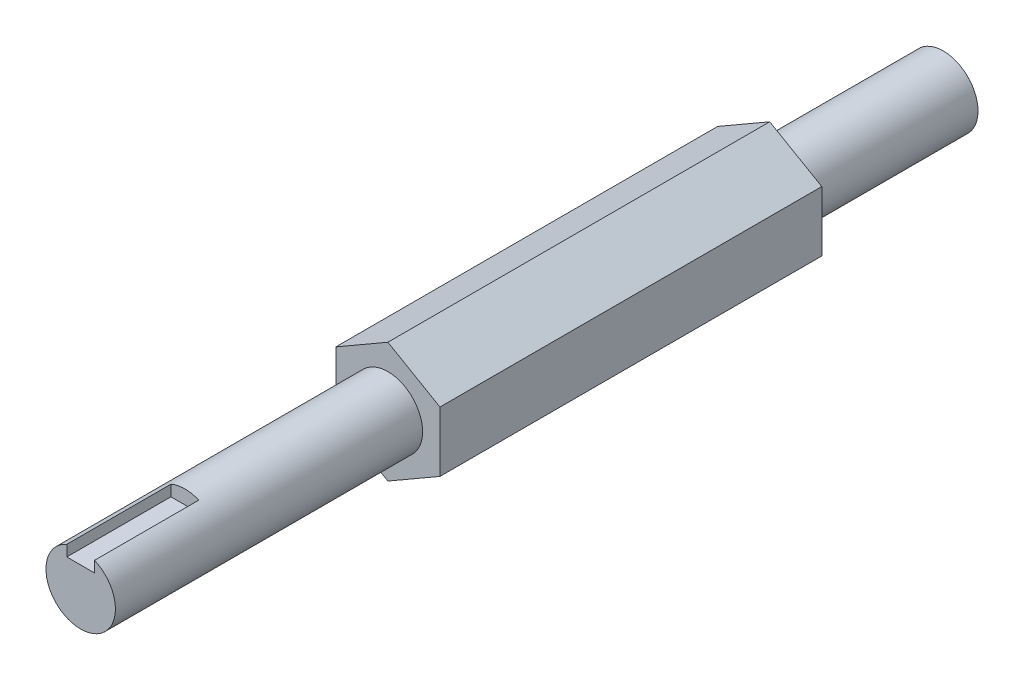
ISO-10303-21;
HEADER;
FILE_DESCRIPTION(('STEP AP214'),'2;1');
FILE_NAME('part.step','',(''),(''),'','','');
FILE_SCHEMA(('AUTOMOTIVE_DESIGN { 1 0 10303 214 1 1 1 1 }'));
ENDSEC;
DATA;
#1=APPLICATION_CONTEXT('core data for automotive mechanical design processes');
#2=APPLICATION_PROTOCOL_DEFINITION('international standard','automotive_design',2000,#1);
#3=PRODUCT_CONTEXT('',#1,'mechanical');
#4=PRODUCT('Part','Part','',(#3));
#5=PRODUCT_RELATED_PRODUCT_CATEGORY('part','',(#4));
#6=PRODUCT_DEFINITION_FORMATION('','',#4);
#7=PRODUCT_DEFINITION_CONTEXT('part definition',#1,'design');
#8=PRODUCT_DEFINITION('design','',#6,#7);
#9=PRODUCT_DEFINITION_SHAPE('','',#8);
#10=(LENGTH_UNIT() NAMED_UNIT(*) SI_UNIT(.MILLI.,.METRE.));
#11=(NAMED_UNIT(*) PLANE_ANGLE_UNIT() SI_UNIT($,.RADIAN.));
#12=(NAMED_UNIT(*) SI_UNIT($,.STERADIAN.) SOLID_ANGLE_UNIT());
#13=UNCERTAINTY_MEASURE_WITH_UNIT(LENGTH_MEASURE(1.E-05),#10,'distance_accuracy_value','');
#14=(GEOMETRIC_REPRESENTATION_CONTEXT(3) GLOBAL_UNCERTAINTY_ASSIGNED_CONTEXT((#13)) GLOBAL_UNIT_ASSIGNED_CONTEXT((#10,
#11,#12)) REPRESENTATION_CONTEXT('',''));
#15=CARTESIAN_POINT('',(0.,0.,0.));
#16=DIRECTION('',(0.,0.,1.));
#17=DIRECTION('',(1.,0.,0.));
#18=AXIS2_PLACEMENT_3D('',#15,#16,#17);
#19=CARTESIAN_POINT('',(0.,17.3205080756888,110.));
#20=DIRECTION('',(0.5,-0.866025403784439,0.));
#21=DIRECTION('',(0.866025403784439,0.5,0.));
#22=AXIS2_PLACEMENT_3D('',#19,#20,#21);
#23=PLANE('',#22);
#24=DIRECTION('',(-0.866025403784439,-0.5,0.));
#25=VECTOR('',#24,1.);
#26=CARTESIAN_POINT('',(0.,17.3205080756888,0.));
#27=LINE('',#26,#25);
#28=CARTESIAN_POINT('',(0.,17.3205080756888,0.));
#29=VERTEX_POINT('',#28);
#30=CARTESIAN_POINT('',(-15.,8.66025403784439,0.));
#31=VERTEX_POINT('',#30);
#32=EDGE_CURVE('E129',#29,#31,#27,.T.);
#33=ORIENTED_EDGE('',*,*,#32,.T.);
#34=DIRECTION('',(0.,0.,-1.));
#35=VECTOR('',#34,1.);
#36=CARTESIAN_POINT('',(-15.,8.66025403784439,110.));
#37=LINE('',#36,#35);
#38=CARTESIAN_POINT('',(-15.,8.66025403784439,110.));
#39=VERTEX_POINT('',#38);
#40=EDGE_CURVE('E148',#39,#31,#37,.T.);
#41=ORIENTED_EDGE('',*,*,#40,.F.);
#42=DIRECTION('',(-0.866025403784439,-0.5,0.));
#43=VECTOR('',#42,1.);
#44=CARTESIAN_POINT('',(0.,17.3205080756888,110.));
#45=LINE('',#44,#43);
#46=CARTESIAN_POINT('',(0.,17.3205080756888,110.));
#47=VERTEX_POINT('',#46);
#48=EDGE_CURVE('E141',#47,#39,#45,.T.);
#49=ORIENTED_EDGE('',*,*,#48,.F.);
#50=DIRECTION('',(0.,0.,-1.));
#51=VECTOR('',#50,1.);
#52=CARTESIAN_POINT('',(0.,17.3205080756888,110.));
#53=LINE('',#52,#51);
#54=EDGE_CURVE('E125',#47,#29,#53,.T.);
#55=ORIENTED_EDGE('',*,*,#54,.T.);
#56=EDGE_LOOP('',(#33,#41,#49,#55));
#57=FACE_BOUND('',#56,.T.);
#58=ADVANCED_FACE('F33',(#57),#23,.F.);
#59=CARTESIAN_POINT('',(-15.,8.66025403784439,110.));
#60=DIRECTION('',(1.,0.,0.));
#61=DIRECTION('',(0.,1.,0.));
#62=AXIS2_PLACEMENT_3D('',#59,#60,#61);
#63=PLANE('',#62);
#64=DIRECTION('',(0.,-1.,0.));
#65=VECTOR('',#64,1.);
#66=CARTESIAN_POINT('',(-15.,8.66025403784439,0.));
#67=LINE('',#66,#65);
#68=CARTESIAN_POINT('',(-15.,-8.66025403784439,0.));
#69=VERTEX_POINT('',#68);
#70=EDGE_CURVE('E132',#31,#69,#67,.T.);
#71=ORIENTED_EDGE('',*,*,#70,.T.);
#72=DIRECTION('',(0.,0.,-1.));
#73=VECTOR('',#72,1.);
#74=CARTESIAN_POINT('',(-15.,-8.66025403784439,110.));
#75=LINE('',#74,#73);
#76=CARTESIAN_POINT('',(-15.,-8.66025403784439,110.));
#77=VERTEX_POINT('',#76);
#78=EDGE_CURVE('E145',#77,#69,#75,.T.);
#79=ORIENTED_EDGE('',*,*,#78,.F.);
#80=DIRECTION('',(0.,-1.,0.));
#81=VECTOR('',#80,1.);
#82=CARTESIAN_POINT('',(-15.,8.66025403784439,110.));
#83=LINE('',#82,#81);
#84=EDGE_CURVE('E92',#39,#77,#83,.T.);
#85=ORIENTED_EDGE('',*,*,#84,.F.);
#86=ORIENTED_EDGE('',*,*,#40,.T.);
#87=EDGE_LOOP('',(#71,#79,#85,#86));
#88=FACE_BOUND('',#87,.T.);
#89=ADVANCED_FACE('F197',(#88),#63,.F.);
#90=CARTESIAN_POINT('',(-15.,-8.66025403784439,110.));
#91=DIRECTION('',(0.5,0.866025403784439,0.));
#92=DIRECTION('',(-0.866025403784438,0.5,0.));
#93=AXIS2_PLACEMENT_3D('',#90,#91,#92);
#94=PLANE('',#93);
#95=DIRECTION('',(0.866025403784439,-0.5,0.));
#96=VECTOR('',#95,1.);
#97=CARTESIAN_POINT('',(-15.,-8.66025403784439,0.));
#98=LINE('',#97,#96);
#99=CARTESIAN_POINT('',(0.,-17.3205080756888,0.));
#100=VERTEX_POINT('',#99);
#101=EDGE_CURVE('E135',#69,#100,#98,.T.);
#102=ORIENTED_EDGE('',*,*,#101,.T.);
#103=DIRECTION('',(0.,0.,-1.));
#104=VECTOR('',#103,1.);
#105=CARTESIAN_POINT('',(0.,-17.3205080756888,110.));
#106=LINE('',#105,#104);
#107=CARTESIAN_POINT('',(0.,-17.3205080756888,110.));
#108=VERTEX_POINT('',#107);
#109=EDGE_CURVE('E120',#108,#100,#106,.T.);
#110=ORIENTED_EDGE('',*,*,#109,.F.);
#111=DIRECTION('',(0.866025403784439,-0.5,0.));
#112=VECTOR('',#111,1.);
#113=CARTESIAN_POINT('',(-15.,-8.66025403784439,110.));
#114=LINE('',#113,#112);
#115=EDGE_CURVE('E108',#77,#108,#114,.T.);
#116=ORIENTED_EDGE('',*,*,#115,.F.);
#117=ORIENTED_EDGE('',*,*,#78,.T.);
#118=EDGE_LOOP('',(#102,#110,#116,#117));
#119=FACE_BOUND('',#118,.T.);
#120=ADVANCED_FACE('F200',(#119),#94,.F.);
#121=CARTESIAN_POINT('',(0.,-17.3205080756888,110.));
#122=DIRECTION('',(-0.5,0.866025403784439,0.));
#123=DIRECTION('',(-0.866025403784439,-0.5,0.));
#124=AXIS2_PLACEMENT_3D('',#121,#122,#123);
#125=PLANE('',#124);
#126=DIRECTION('',(0.866025403784439,0.5,0.));
#127=VECTOR('',#126,1.);
#128=CARTESIAN_POINT('',(0.,-17.3205080756888,0.));
#129=LINE('',#128,#127);
#130=CARTESIAN_POINT('',(15.,-8.66025403784439,0.));
#131=VERTEX_POINT('',#130);
#132=EDGE_CURVE('E117',#100,#131,#129,.T.);
#133=ORIENTED_EDGE('',*,*,#132,.T.);
#134=DIRECTION('',(0.,0.,-1.));
#135=VECTOR('',#134,1.);
#136=CARTESIAN_POINT('',(15.,-8.66025403784439,110.));
#137=LINE('',#136,#135);
#138=CARTESIAN_POINT('',(15.,-8.66025403784439,110.));
#139=VERTEX_POINT('',#138);
#140=EDGE_CURVE('E114',#139,#131,#137,.T.);
#141=ORIENTED_EDGE('',*,*,#140,.F.);
#142=DIRECTION('',(0.866025403784439,0.5,0.));
#143=VECTOR('',#142,1.);
#144=CARTESIAN_POINT('',(0.,-17.3205080756888,110.));
#145=LINE('',#144,#143);
#146=EDGE_CURVE('E101',#108,#139,#145,.T.);
#147=ORIENTED_EDGE('',*,*,#146,.F.);
#148=ORIENTED_EDGE('',*,*,#109,.T.);
#149=EDGE_LOOP('',(#133,#141,#147,#148));
#150=FACE_BOUND('',#149,.T.);
#151=ADVANCED_FACE('F115',(#150),#125,.F.);
#152=CARTESIAN_POINT('',(15.,-8.66025403784439,110.));
#153=DIRECTION('',(-1.,0.,0.));
#154=DIRECTION('',(0.,-1.,0.));
#155=AXIS2_PLACEMENT_3D('',#152,#153,#154);
#156=PLANE('',#155);
#157=DIRECTION('',(0.,1.,0.));
#158=VECTOR('',#157,1.);
#159=CARTESIAN_POINT('',(15.,-8.66025403784439,0.));
#160=LINE('',#159,#158);
#161=CARTESIAN_POINT('',(15.,8.66025403784438,0.));
#162=VERTEX_POINT('',#161);
#163=EDGE_CURVE('E138',#131,#162,#160,.T.);
#164=ORIENTED_EDGE('',*,*,#163,.T.);
#165=DIRECTION('',(0.,0.,-1.));
#166=VECTOR('',#165,1.);
#167=CARTESIAN_POINT('',(15.,8.66025403784438,110.));
#168=LINE('',#167,#166);
#169=CARTESIAN_POINT('',(15.,8.66025403784438,110.));
#170=VERTEX_POINT('',#169);
#171=EDGE_CURVE('E121',#170,#162,#168,.T.);
#172=ORIENTED_EDGE('',*,*,#171,.F.);
#173=DIRECTION('',(0.,1.,0.));
#174=VECTOR('',#173,1.);
#175=CARTESIAN_POINT('',(15.,-8.66025403784439,110.));
#176=LINE('',#175,#174);
#177=EDGE_CURVE('E105',#139,#170,#176,.T.);
#178=ORIENTED_EDGE('',*,*,#177,.F.);
#179=ORIENTED_EDGE('',*,*,#140,.T.);
#180=EDGE_LOOP('',(#164,#172,#178,#179));
#181=FACE_BOUND('',#180,.T.);
#182=ADVANCED_FACE('F123',(#181),#156,.F.);
#183=CARTESIAN_POINT('',(15.,8.66025403784438,110.));
#184=DIRECTION('',(-0.5,-0.866025403784439,0.));
#185=DIRECTION('',(0.866025403784439,-0.5,0.));
#186=AXIS2_PLACEMENT_3D('',#183,#184,#185);
#187=PLANE('',#186);
#188=DIRECTION('',(-0.866025403784438,0.5,0.));
#189=VECTOR('',#188,1.);
#190=CARTESIAN_POINT('',(15.,8.66025403784438,0.));
#191=LINE('',#190,#189);
#192=EDGE_CURVE('E83',#162,#29,#191,.T.);
#193=ORIENTED_EDGE('',*,*,#192,.T.);
#194=ORIENTED_EDGE('',*,*,#54,.F.);
#195=DIRECTION('',(-0.866025403784438,0.5,0.));
#196=VECTOR('',#195,1.);
#197=CARTESIAN_POINT('',(15.,8.66025403784438,110.));
#198=LINE('',#197,#196);
#199=EDGE_CURVE('E56',#170,#47,#198,.T.);
#200=ORIENTED_EDGE('',*,*,#199,.F.);
#201=ORIENTED_EDGE('',*,*,#171,.T.);
#202=EDGE_LOOP('',(#193,#194,#200,#201));
#203=FACE_BOUND('',#202,.T.);
#204=ADVANCED_FACE('F204',(#203),#187,.F.);
#205=CARTESIAN_POINT('',(0.,0.,110.));
#206=DIRECTION('',(0.,0.,1.));
#207=DIRECTION('',(1.,0.,0.));
#208=AXIS2_PLACEMENT_3D('',#205,#206,#207);
#209=PLANE('',#208);
#210=CARTESIAN_POINT('',(0.,0.,110.));
#211=DIRECTION('',(0.,0.,1.));
#212=DIRECTION('',(1.,0.,0.));
#213=AXIS2_PLACEMENT_3D('',#210,#211,#212);
#214=CIRCLE('',#213,10.);
#215=CARTESIAN_POINT('',(10.,0.,110.));
#216=VERTEX_POINT('',#215);
#217=EDGE_CURVE('E190',#216,#216,#214,.T.);
#218=ORIENTED_EDGE('',*,*,#217,.F.);
#219=EDGE_LOOP('',(#218));
#220=FACE_BOUND('',#219,.T.);
#221=ORIENTED_EDGE('',*,*,#48,.T.);
#222=ORIENTED_EDGE('',*,*,#84,.T.);
#223=ORIENTED_EDGE('',*,*,#115,.T.);
#224=ORIENTED_EDGE('',*,*,#146,.T.);
#225=ORIENTED_EDGE('',*,*,#177,.T.);
#226=ORIENTED_EDGE('',*,*,#199,.T.);
#227=EDGE_LOOP('',(#221,#222,#223,#224,#225,#226));
#228=FACE_BOUND('',#227,.T.);
#229=ADVANCED_FACE('F103',(#220,#228),#209,.T.);
#230=CARTESIAN_POINT('',(0.,0.,0.));
#231=DIRECTION('',(0.,0.,1.));
#232=DIRECTION('',(1.,0.,0.));
#233=AXIS2_PLACEMENT_3D('',#230,#231,#232);
#234=PLANE('',#233);
#235=CARTESIAN_POINT('',(0.,0.,0.));
#236=DIRECTION('',(0.,0.,1.));
#237=DIRECTION('',(1.,0.,0.));
#238=AXIS2_PLACEMENT_3D('',#235,#236,#237);
#239=CIRCLE('',#238,10.);
#240=CARTESIAN_POINT('',(10.,0.,0.));
#241=VERTEX_POINT('',#240);
#242=EDGE_CURVE('E150',#241,#241,#239,.F.);
#243=ORIENTED_EDGE('',*,*,#242,.F.);
#244=EDGE_LOOP('',(#243));
#245=FACE_BOUND('',#244,.T.);
#246=ORIENTED_EDGE('',*,*,#32,.F.);
#247=ORIENTED_EDGE('',*,*,#192,.F.);
#248=ORIENTED_EDGE('',*,*,#163,.F.);
#249=ORIENTED_EDGE('',*,*,#132,.F.);
#250=ORIENTED_EDGE('',*,*,#101,.F.);
#251=ORIENTED_EDGE('',*,*,#70,.F.);
#252=EDGE_LOOP('',(#246,#247,#248,#249,#250,#251));
#253=FACE_BOUND('',#252,.T.);
#254=ADVANCED_FACE('F203',(#245,#253),#234,.F.);
#255=CARTESIAN_POINT('',(0.,0.,198.5));
#256=DIRECTION('',(0.,0.,-1.));
#257=DIRECTION('',(-1.,0.,0.));
#258=AXIS2_PLACEMENT_3D('',#255,#256,#257);
#259=CYLINDRICAL_SURFACE('',#258,10.);
#260=CARTESIAN_POINT('',(0.,0.,198.5));
#261=DIRECTION('',(0.,0.,1.));
#262=DIRECTION('',(1.,0.,0.));
#263=AXIS2_PLACEMENT_3D('',#260,#261,#262);
#264=CIRCLE('',#263,10.);
#265=CARTESIAN_POINT('',(-4.,9.16515138991168,198.5));
#266=VERTEX_POINT('',#265);
#267=CARTESIAN_POINT('',(4.,9.16515138991168,198.5));
#268=VERTEX_POINT('',#267);
#269=EDGE_CURVE('E133',#266,#268,#264,.T.);
#270=ORIENTED_EDGE('',*,*,#269,.F.);
#271=DIRECTION('',(0.,0.,-1.));
#272=VECTOR('',#271,1.);
#273=CARTESIAN_POINT('',(-4.,9.16515138991168,198.5));
#274=LINE('',#273,#272);
#275=CARTESIAN_POINT('',(-4.,9.16515138991168,168.5));
#276=VERTEX_POINT('',#275);
#277=EDGE_CURVE('E161',#266,#276,#274,.T.);
#278=ORIENTED_EDGE('',*,*,#277,.T.);
#279=CARTESIAN_POINT('',(0.,0.,168.5));
#280=DIRECTION('',(0.,0.,1.));
#281=DIRECTION('',(1.,0.,0.));
#282=AXIS2_PLACEMENT_3D('',#279,#280,#281);
#283=CIRCLE('',#282,10.);
#284=CARTESIAN_POINT('',(4.,9.16515138991168,168.5));
#285=VERTEX_POINT('',#284);
#286=EDGE_CURVE('E11',#285,#276,#283,.T.);
#287=ORIENTED_EDGE('',*,*,#286,.F.);
#288=DIRECTION('',(0.,0.,-1.));
#289=VECTOR('',#288,1.);
#290=CARTESIAN_POINT('',(4.,9.16515138991168,198.5));
#291=LINE('',#290,#289);
#292=EDGE_CURVE('E182',#285,#268,#291,.F.);
#293=ORIENTED_EDGE('',*,*,#292,.T.);
#294=EDGE_LOOP('',(#270,#278,#287,#293));
#295=FACE_BOUND('',#294,.T.);
#296=ORIENTED_EDGE('',*,*,#217,.T.);
#297=EDGE_LOOP('',(#296));
#298=FACE_BOUND('',#297,.T.);
#299=ADVANCED_FACE('F223',(#295,#298),#259,.T.);
#300=CARTESIAN_POINT('',(0.,0.,198.5));
#301=DIRECTION('',(0.,0.,1.));
#302=DIRECTION('',(1.,0.,0.));
#303=AXIS2_PLACEMENT_3D('',#300,#301,#302);
#304=PLANE('',#303);
#305=DIRECTION('',(0.,-1.,0.));
#306=VECTOR('',#305,1.);
#307=CARTESIAN_POINT('',(-4.,0.,198.5));
#308=LINE('',#307,#306);
#309=CARTESIAN_POINT('',(-4.,6.,198.5));
#310=VERTEX_POINT('',#309);
#311=EDGE_CURVE('E40',#266,#310,#308,.T.);
#312=ORIENTED_EDGE('',*,*,#311,.F.);
#313=ORIENTED_EDGE('',*,*,#269,.T.);
#314=DIRECTION('',(0.,1.,0.));
#315=VECTOR('',#314,1.);
#316=CARTESIAN_POINT('',(4.,6.,198.5));
#317=LINE('',#316,#315);
#318=CARTESIAN_POINT('',(4.,6.,198.5));
#319=VERTEX_POINT('',#318);
#320=EDGE_CURVE('E170',#319,#268,#317,.T.);
#321=ORIENTED_EDGE('',*,*,#320,.F.);
#322=DIRECTION('',(1.,0.,0.));
#323=VECTOR('',#322,1.);
#324=CARTESIAN_POINT('',(4.,6.,198.5));
#325=LINE('',#324,#323);
#326=EDGE_CURVE('E166',#310,#319,#325,.T.);
#327=ORIENTED_EDGE('',*,*,#326,.F.);
#328=EDGE_LOOP('',(#312,#313,#321,#327));
#329=FACE_BOUND('',#328,.T.);
#330=ADVANCED_FACE('F167',(#329),#304,.T.);
#331=CARTESIAN_POINT('',(0.,0.,-50.));
#332=DIRECTION('',(0.,0.,1.));
#333=DIRECTION('',(1.,0.,0.));
#334=AXIS2_PLACEMENT_3D('',#331,#332,#333);
#335=CYLINDRICAL_SURFACE('',#334,10.);
#336=CARTESIAN_POINT('',(0.,0.,-50.));
#337=DIRECTION('',(0.,0.,-1.));
#338=DIRECTION('',(-1.,0.,0.));
#339=AXIS2_PLACEMENT_3D('',#336,#337,#338);
#340=CIRCLE('',#339,10.);
#341=CARTESIAN_POINT('',(-10.,0.,-50.));
#342=VERTEX_POINT('',#341);
#343=EDGE_CURVE('E187',#342,#342,#340,.T.);
#344=ORIENTED_EDGE('',*,*,#343,.F.);
#345=EDGE_LOOP('',(#344));
#346=FACE_BOUND('',#345,.T.);
#347=ORIENTED_EDGE('',*,*,#242,.T.);
#348=EDGE_LOOP('',(#347));
#349=FACE_BOUND('',#348,.T.);
#350=ADVANCED_FACE('F233',(#346,#349),#335,.T.);
#351=CARTESIAN_POINT('',(0.,0.,-50.));
#352=DIRECTION('',(0.,0.,-1.));
#353=DIRECTION('',(-1.,0.,0.));
#354=AXIS2_PLACEMENT_3D('',#351,#352,#353);
#355=PLANE('',#354);
#356=ORIENTED_EDGE('',*,*,#343,.T.);
#357=EDGE_LOOP('',(#356));
#358=FACE_BOUND('',#357,.T.);
#359=ADVANCED_FACE('F236',(#358),#355,.T.);
#360=CARTESIAN_POINT('',(0.,0.,168.5));
#361=DIRECTION('',(0.,0.,1.));
#362=DIRECTION('',(1.,0.,0.));
#363=AXIS2_PLACEMENT_3D('',#360,#361,#362);
#364=PLANE('',#363);
#365=ORIENTED_EDGE('',*,*,#286,.T.);
#366=DIRECTION('',(0.,-1.,0.));
#367=VECTOR('',#366,1.);
#368=CARTESIAN_POINT('',(-4.,6.,168.5));
#369=LINE('',#368,#367);
#370=CARTESIAN_POINT('',(-4.,6.,168.5));
#371=VERTEX_POINT('',#370);
#372=EDGE_CURVE('E173',#276,#371,#369,.T.);
#373=ORIENTED_EDGE('',*,*,#372,.T.);
#374=DIRECTION('',(1.,0.,0.));
#375=VECTOR('',#374,1.);
#376=CARTESIAN_POINT('',(4.,6.,168.5));
#377=LINE('',#376,#375);
#378=CARTESIAN_POINT('',(4.,6.,168.5));
#379=VERTEX_POINT('',#378);
#380=EDGE_CURVE('E261',#371,#379,#377,.T.);
#381=ORIENTED_EDGE('',*,*,#380,.T.);
#382=DIRECTION('',(0.,1.,0.));
#383=VECTOR('',#382,1.);
#384=CARTESIAN_POINT('',(4.,6.,168.5));
#385=LINE('',#384,#383);
#386=EDGE_CURVE('E176',#379,#285,#385,.T.);
#387=ORIENTED_EDGE('',*,*,#386,.T.);
#388=EDGE_LOOP('',(#365,#373,#381,#387));
#389=FACE_BOUND('',#388,.T.);
#390=ADVANCED_FACE('F240',(#389),#364,.T.);
#391=CARTESIAN_POINT('',(-4.,6.,168.5));
#392=DIRECTION('',(-1.,0.,0.));
#393=DIRECTION('',(0.,-1.,0.));
#394=AXIS2_PLACEMENT_3D('',#391,#392,#393);
#395=PLANE('',#394);
#396=ORIENTED_EDGE('',*,*,#311,.T.);
#397=DIRECTION('',(0.,0.,1.));
#398=VECTOR('',#397,1.);
#399=CARTESIAN_POINT('',(-4.,6.,168.5));
#400=LINE('',#399,#398);
#401=EDGE_CURVE('E47',#371,#310,#400,.T.);
#402=ORIENTED_EDGE('',*,*,#401,.F.);
#403=ORIENTED_EDGE('',*,*,#372,.F.);
#404=ORIENTED_EDGE('',*,*,#277,.F.);
#405=EDGE_LOOP('',(#396,#402,#403,#404));
#406=FACE_BOUND('',#405,.T.);
#407=ADVANCED_FACE('F156',(#406),#395,.F.);
#408=CARTESIAN_POINT('',(4.,6.,168.5));
#409=DIRECTION('',(1.,0.,0.));
#410=DIRECTION('',(0.,0.,-1.));
#411=AXIS2_PLACEMENT_3D('',#408,#409,#410);
#412=PLANE('',#411);
#413=ORIENTED_EDGE('',*,*,#386,.F.);
#414=DIRECTION('',(0.,0.,1.));
#415=VECTOR('',#414,1.);
#416=CARTESIAN_POINT('',(4.,6.,168.5));
#417=LINE('',#416,#415);
#418=EDGE_CURVE('E179',#379,#319,#417,.T.);
#419=ORIENTED_EDGE('',*,*,#418,.T.);
#420=ORIENTED_EDGE('',*,*,#320,.T.);
#421=ORIENTED_EDGE('',*,*,#292,.F.);
#422=EDGE_LOOP('',(#413,#419,#420,#421));
#423=FACE_BOUND('',#422,.T.);
#424=ADVANCED_FACE('F244',(#423),#412,.F.);
#425=CARTESIAN_POINT('',(4.,6.,168.5));
#426=DIRECTION('',(0.,-1.,0.));
#427=DIRECTION('',(0.,0.,-1.));
#428=AXIS2_PLACEMENT_3D('',#425,#426,#427);
#429=PLANE('',#428);
#430=ORIENTED_EDGE('',*,*,#326,.T.);
#431=ORIENTED_EDGE('',*,*,#418,.F.);
#432=ORIENTED_EDGE('',*,*,#380,.F.);
#433=ORIENTED_EDGE('',*,*,#401,.T.);
#434=EDGE_LOOP('',(#430,#431,#432,#433));
#435=FACE_BOUND('',#434,.T.);
#436=ADVANCED_FACE('F245',(#435),#429,.F.);
#437=CLOSED_SHELL('',(#58,#89,#120,#151,#182,#204,#229,#254,#299,#330,#350,#359,#390,#407,#424,#436));
#438=MANIFOLD_SOLID_BREP('B2',#437);
#439=ADVANCED_BREP_SHAPE_REPRESENTATION('',(#18,#438),#14);
#440=SHAPE_DEFINITION_REPRESENTATION(#9,#439);
ENDSEC;
END-ISO-10303-21;
